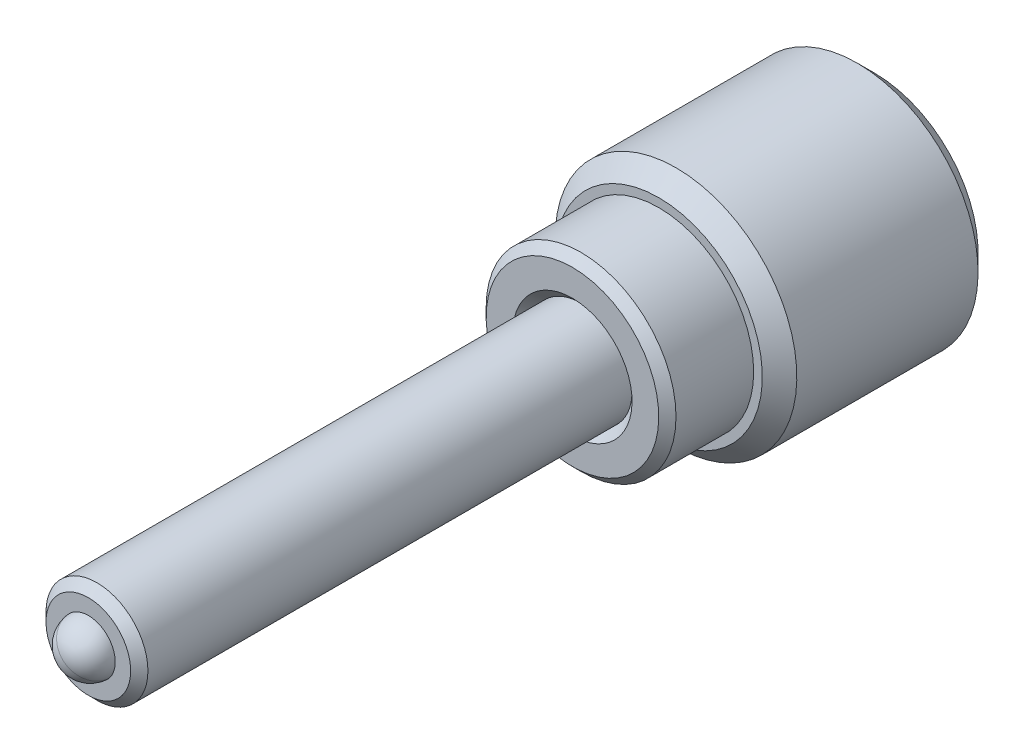
ISO-10303-21;
HEADER;
FILE_DESCRIPTION(('STEP AP214'),'2;1');
FILE_NAME('part.step','',(''),(''),'','','');
FILE_SCHEMA(('AUTOMOTIVE_DESIGN { 1 0 10303 214 1 1 1 1 }'));
ENDSEC;
DATA;
#1=APPLICATION_CONTEXT('core data for automotive mechanical design processes');
#2=APPLICATION_PROTOCOL_DEFINITION('international standard','automotive_design',2000,#1);
#3=PRODUCT_CONTEXT('',#1,'mechanical');
#4=PRODUCT('Part','Part','',(#3));
#5=PRODUCT_RELATED_PRODUCT_CATEGORY('part','',(#4));
#6=PRODUCT_DEFINITION_FORMATION('','',#4);
#7=PRODUCT_DEFINITION_CONTEXT('part definition',#1,'design');
#8=PRODUCT_DEFINITION('design','',#6,#7);
#9=PRODUCT_DEFINITION_SHAPE('','',#8);
#10=(LENGTH_UNIT() NAMED_UNIT(*) SI_UNIT(.MILLI.,.METRE.));
#11=(NAMED_UNIT(*) PLANE_ANGLE_UNIT() SI_UNIT($,.RADIAN.));
#12=(NAMED_UNIT(*) SI_UNIT($,.STERADIAN.) SOLID_ANGLE_UNIT());
#13=UNCERTAINTY_MEASURE_WITH_UNIT(LENGTH_MEASURE(1.E-05),#10,'distance_accuracy_value','');
#14=(GEOMETRIC_REPRESENTATION_CONTEXT(3) GLOBAL_UNCERTAINTY_ASSIGNED_CONTEXT((#13)) GLOBAL_UNIT_ASSIGNED_CONTEXT((#10,
#11,#12)) REPRESENTATION_CONTEXT('',''));
#15=CARTESIAN_POINT('',(0.,0.,0.));
#16=DIRECTION('',(0.,0.,1.));
#17=DIRECTION('',(1.,0.,0.));
#18=AXIS2_PLACEMENT_3D('',#15,#16,#17);
#19=CARTESIAN_POINT('',(-7.26919512616077,-0.0930907809788475,-15.998498581485));
#20=DIRECTION('',(0.,0.,-1.));
#21=DIRECTION('',(0.,1.,0.));
#22=AXIS2_PLACEMENT_3D('',#19,#20,#21);
#23=PLANE('',#22);
#24=CARTESIAN_POINT('',(-1.45830924969914,-0.0930907809788471,-15.998498581485));
#25=DIRECTION('',(0.,0.,-1.));
#26=DIRECTION('',(0.,1.,0.));
#27=AXIS2_PLACEMENT_3D('',#24,#25,#26);
#28=CIRCLE('',#27,2.413);
#29=CARTESIAN_POINT('',(-1.45830924969914,2.31990921902115,-15.998498581485));
#30=VERTEX_POINT('',#29);
#31=EDGE_CURVE('P0_E29',#30,#30,#28,.T.);
#32=ORIENTED_EDGE('',*,*,#31,.T.);
#33=EDGE_LOOP('',(#32));
#34=FACE_BOUND('',#33,.T.);
#35=CARTESIAN_POINT('',(-1.45830924969914,-0.0930907809788471,-15.998498581485));
#36=DIRECTION('',(0.,0.,-1.));
#37=DIRECTION('',(-1.,0.,0.));
#38=AXIS2_PLACEMENT_3D('',#35,#36,#37);
#39=CIRCLE('',#38,1.15470053837925);
#40=CARTESIAN_POINT('',(-2.03565951888877,0.906909219021155,-15.998498581485));
#41=VERTEX_POINT('',#40);
#42=CARTESIAN_POINT('',(-0.880958980509518,0.906909219021155,-15.998498581485));
#43=VERTEX_POINT('',#42);
#44=EDGE_CURVE('P0_E42',#41,#43,#39,.T.);
#45=ORIENTED_EDGE('',*,*,#44,.F.);
#46=CARTESIAN_POINT('',(-2.61300978807839,-0.093090780978849,-15.998498581485));
#47=VERTEX_POINT('',#46);
#48=EDGE_CURVE('P0_E110',#47,#41,#39,.T.);
#49=ORIENTED_EDGE('',*,*,#48,.F.);
#50=CARTESIAN_POINT('',(-2.03565951888877,-1.09309078097885,-15.998498581485));
#51=VERTEX_POINT('',#50);
#52=EDGE_CURVE('P0_E109',#51,#47,#39,.T.);
#53=ORIENTED_EDGE('',*,*,#52,.F.);
#54=CARTESIAN_POINT('',(-0.880958980509515,-1.09309078097885,-15.998498581485));
#55=VERTEX_POINT('',#54);
#56=EDGE_CURVE('P0_E81',#55,#51,#39,.T.);
#57=ORIENTED_EDGE('',*,*,#56,.F.);
#58=CARTESIAN_POINT('',(-0.303608711319889,-0.0930907809788469,-15.998498581485));
#59=VERTEX_POINT('',#58);
#60=EDGE_CURVE('P0_E74',#59,#55,#39,.T.);
#61=ORIENTED_EDGE('',*,*,#60,.F.);
#62=EDGE_CURVE('P0_E35',#43,#59,#39,.T.);
#63=ORIENTED_EDGE('',*,*,#62,.F.);
#64=EDGE_LOOP('',(#45,#49,#53,#57,#61,#63));
#65=FACE_BOUND('',#64,.T.);
#66=ADVANCED_FACE('P0_F16',(#34,#65),#23,.T.);
#67=CARTESIAN_POINT('',(-1.45830924969914,-0.0930907809788465,-16.506498581485));
#68=DIRECTION('',(0.,0.,-1.));
#69=DIRECTION('',(0.,1.,0.));
#70=AXIS2_PLACEMENT_3D('',#67,#68,#69);
#71=CYLINDRICAL_SURFACE('',#70,2.413);
#72=CARTESIAN_POINT('',(-1.45830924969914,-0.0930907809788465,-16.506498581485));
#73=DIRECTION('',(0.,0.,-1.));
#74=DIRECTION('',(0.,1.,0.));
#75=AXIS2_PLACEMENT_3D('',#72,#73,#74);
#76=CIRCLE('',#75,2.413);
#77=CARTESIAN_POINT('',(-1.45830924969914,2.31990921902116,-16.506498581485));
#78=VERTEX_POINT('',#77);
#79=EDGE_CURVE('P0_E189',#78,#78,#76,.T.);
#80=ORIENTED_EDGE('',*,*,#79,.T.);
#81=EDGE_LOOP('',(#80));
#82=FACE_BOUND('',#81,.T.);
#83=ORIENTED_EDGE('',*,*,#31,.F.);
#84=EDGE_LOOP('',(#83));
#85=FACE_BOUND('',#84,.T.);
#86=ADVANCED_FACE('P0_F177',(#82,#85),#71,.F.);
#87=CARTESIAN_POINT('',(-7.26919512616077,-0.0930907809788469,-16.506498581485));
#88=DIRECTION('',(0.,0.,-1.));
#89=DIRECTION('',(0.,1.,0.));
#90=AXIS2_PLACEMENT_3D('',#87,#88,#89);
#91=PLANE('',#90);
#92=CARTESIAN_POINT('',(-1.45830924969914,-0.0930907809788465,-16.506498581485));
#93=DIRECTION('',(0.,0.,-1.));
#94=DIRECTION('',(0.,1.,0.));
#95=AXIS2_PLACEMENT_3D('',#92,#93,#94);
#96=CIRCLE('',#95,3.048);
#97=CARTESIAN_POINT('',(-1.45830924969914,2.95490921902116,-16.506498581485));
#98=VERTEX_POINT('',#97);
#99=EDGE_CURVE('P0_E191',#98,#98,#96,.T.);
#100=ORIENTED_EDGE('',*,*,#99,.T.);
#101=EDGE_LOOP('',(#100));
#102=FACE_BOUND('',#101,.T.);
#103=ORIENTED_EDGE('',*,*,#79,.F.);
#104=EDGE_LOOP('',(#103));
#105=FACE_BOUND('',#104,.T.);
#106=ADVANCED_FACE('P0_F184',(#102,#105),#91,.T.);
#107=CARTESIAN_POINT('',(-1.45830924969914,-0.0930907809788465,-16.506498581485));
#108=DIRECTION('',(0.,0.,1.));
#109=DIRECTION('',(0.,-1.,0.));
#110=AXIS2_PLACEMENT_3D('',#107,#108,#109);
#111=CONICAL_SURFACE('',#110,3.048,0.78539816339745);
#112=CARTESIAN_POINT('',(-1.45830924969914,-0.0930907809788471,-15.998498581485));
#113=DIRECTION('',(0.,0.,-1.));
#114=DIRECTION('',(0.,1.,0.));
#115=AXIS2_PLACEMENT_3D('',#112,#113,#114);
#116=CIRCLE('',#115,3.556);
#117=CARTESIAN_POINT('',(-1.45830924969914,3.46290921902116,-15.998498581485));
#118=VERTEX_POINT('',#117);
#119=EDGE_CURVE('P0_E196',#118,#118,#116,.T.);
#120=ORIENTED_EDGE('',*,*,#119,.T.);
#121=EDGE_LOOP('',(#120));
#122=FACE_BOUND('',#121,.T.);
#123=ORIENTED_EDGE('',*,*,#99,.F.);
#124=EDGE_LOOP('',(#123));
#125=FACE_BOUND('',#124,.T.);
#126=ADVANCED_FACE('P0_F307',(#122,#125),#111,.T.);
#127=CARTESIAN_POINT('',(-1.45830924969914,-0.0930907809788465,-16.506498581485));
#128=DIRECTION('',(0.,0.,-1.));
#129=DIRECTION('',(0.,1.,0.));
#130=AXIS2_PLACEMENT_3D('',#127,#128,#129);
#131=CYLINDRICAL_SURFACE('',#130,3.556);
#132=CARTESIAN_POINT('',(-1.45830924969914,-0.093090780978853,-10.664498581485));
#133=DIRECTION('',(0.,0.,-1.));
#134=DIRECTION('',(0.,1.,0.));
#135=AXIS2_PLACEMENT_3D('',#132,#133,#134);
#136=CIRCLE('',#135,3.556);
#137=CARTESIAN_POINT('',(-1.45830924969914,3.46290921902115,-10.664498581485));
#138=VERTEX_POINT('',#137);
#139=EDGE_CURVE('P0_E199',#138,#138,#136,.T.);
#140=ORIENTED_EDGE('',*,*,#139,.T.);
#141=EDGE_LOOP('',(#140));
#142=FACE_BOUND('',#141,.T.);
#143=ORIENTED_EDGE('',*,*,#119,.F.);
#144=EDGE_LOOP('',(#143));
#145=FACE_BOUND('',#144,.T.);
#146=ADVANCED_FACE('P0_F303',(#142,#145),#131,.T.);
#147=CARTESIAN_POINT('',(-1.45830924969914,-0.093090780978853,-10.664498581485));
#148=DIRECTION('',(0.,0.,-1.));
#149=DIRECTION('',(0.,1.,0.));
#150=AXIS2_PLACEMENT_3D('',#147,#148,#149);
#151=CONICAL_SURFACE('',#150,3.556,0.78539816339745);
#152=CARTESIAN_POINT('',(-1.45830924969914,-0.0930907809788536,-10.156498581485));
#153=DIRECTION('',(0.,0.,-1.));
#154=DIRECTION('',(0.,1.,0.));
#155=AXIS2_PLACEMENT_3D('',#152,#153,#154);
#156=CIRCLE('',#155,3.048);
#157=CARTESIAN_POINT('',(-1.45830924969914,2.95490921902115,-10.156498581485));
#158=VERTEX_POINT('',#157);
#159=EDGE_CURVE('P0_E202',#158,#158,#156,.T.);
#160=ORIENTED_EDGE('',*,*,#159,.T.);
#161=EDGE_LOOP('',(#160));
#162=FACE_BOUND('',#161,.T.);
#163=ORIENTED_EDGE('',*,*,#139,.F.);
#164=EDGE_LOOP('',(#163));
#165=FACE_BOUND('',#164,.T.);
#166=ADVANCED_FACE('P0_F299',(#162,#165),#151,.T.);
#167=CARTESIAN_POINT('',(-7.26919512616077,-0.093090780978854,-10.156498581485));
#168=DIRECTION('',(0.,0.,1.));
#169=DIRECTION('',(0.,-1.,0.));
#170=AXIS2_PLACEMENT_3D('',#167,#168,#169);
#171=PLANE('',#170);
#172=CARTESIAN_POINT('',(-1.45830924969914,-0.0930907809788536,-10.156498581485));
#173=DIRECTION('',(0.,0.,-1.));
#174=DIRECTION('',(0.,1.,0.));
#175=AXIS2_PLACEMENT_3D('',#172,#173,#174);
#176=CIRCLE('',#175,2.794);
#177=CARTESIAN_POINT('',(-1.45830924969914,2.70090921902115,-10.156498581485));
#178=VERTEX_POINT('',#177);
#179=EDGE_CURVE('P0_E205',#178,#178,#176,.T.);
#180=ORIENTED_EDGE('',*,*,#179,.T.);
#181=EDGE_LOOP('',(#180));
#182=FACE_BOUND('',#181,.T.);
#183=ORIENTED_EDGE('',*,*,#159,.F.);
#184=EDGE_LOOP('',(#183));
#185=FACE_BOUND('',#184,.T.);
#186=ADVANCED_FACE('P0_F295',(#182,#185),#171,.T.);
#187=CARTESIAN_POINT('',(-1.45830924969914,-0.0930907809788465,-16.506498581485));
#188=DIRECTION('',(0.,0.,-1.));
#189=DIRECTION('',(0.,1.,0.));
#190=AXIS2_PLACEMENT_3D('',#187,#188,#189);
#191=CYLINDRICAL_SURFACE('',#190,2.794);
#192=CARTESIAN_POINT('',(-1.45830924969914,-0.0930907809788561,-7.87049858148497));
#193=DIRECTION('',(0.,0.,-1.));
#194=DIRECTION('',(0.,1.,0.));
#195=AXIS2_PLACEMENT_3D('',#192,#193,#194);
#196=CIRCLE('',#195,2.794);
#197=CARTESIAN_POINT('',(-1.45830924969914,2.70090921902115,-7.87049858148496));
#198=VERTEX_POINT('',#197);
#199=EDGE_CURVE('P0_E208',#198,#198,#196,.T.);
#200=ORIENTED_EDGE('',*,*,#199,.T.);
#201=EDGE_LOOP('',(#200));
#202=FACE_BOUND('',#201,.T.);
#203=ORIENTED_EDGE('',*,*,#179,.F.);
#204=EDGE_LOOP('',(#203));
#205=FACE_BOUND('',#204,.T.);
#206=ADVANCED_FACE('P0_F291',(#202,#205),#191,.T.);
#207=CARTESIAN_POINT('',(-1.45830924969914,-0.0930907809788561,-7.87049858148497));
#208=DIRECTION('',(0.,0.,-1.));
#209=DIRECTION('',(0.,1.,0.));
#210=AXIS2_PLACEMENT_3D('',#207,#208,#209);
#211=CONICAL_SURFACE('',#210,2.794,0.785398163397447);
#212=CARTESIAN_POINT('',(-1.45830924969914,-0.0930907809788564,-7.61649858148497));
#213=DIRECTION('',(0.,0.,-1.));
#214=DIRECTION('',(0.,1.,0.));
#215=AXIS2_PLACEMENT_3D('',#212,#213,#214);
#216=CIRCLE('',#215,2.54);
#217=CARTESIAN_POINT('',(-1.45830924969914,2.44690921902115,-7.61649858148497));
#218=VERTEX_POINT('',#217);
#219=EDGE_CURVE('P0_E211',#218,#218,#216,.T.);
#220=ORIENTED_EDGE('',*,*,#219,.T.);
#221=EDGE_LOOP('',(#220));
#222=FACE_BOUND('',#221,.T.);
#223=ORIENTED_EDGE('',*,*,#199,.F.);
#224=EDGE_LOOP('',(#223));
#225=FACE_BOUND('',#224,.T.);
#226=ADVANCED_FACE('P0_F287',(#222,#225),#211,.T.);
#227=CARTESIAN_POINT('',(-7.26919512616077,-0.0930907809788568,-7.61649858148497));
#228=DIRECTION('',(0.,0.,1.));
#229=DIRECTION('',(0.,-1.,0.));
#230=AXIS2_PLACEMENT_3D('',#227,#228,#229);
#231=PLANE('',#230);
#232=CARTESIAN_POINT('',(-1.45830924969914,-0.0930907809788564,-7.61649858148497));
#233=DIRECTION('',(0.,0.,-1.));
#234=DIRECTION('',(0.,1.,0.));
#235=AXIS2_PLACEMENT_3D('',#232,#233,#234);
#236=CIRCLE('',#235,1.754);
#237=CARTESIAN_POINT('',(-1.45830924969914,1.66090921902115,-7.61649858148497));
#238=VERTEX_POINT('',#237);
#239=EDGE_CURVE('P0_E214',#238,#238,#236,.T.);
#240=ORIENTED_EDGE('',*,*,#239,.T.);
#241=EDGE_LOOP('',(#240));
#242=FACE_BOUND('',#241,.T.);
#243=ORIENTED_EDGE('',*,*,#219,.F.);
#244=EDGE_LOOP('',(#243));
#245=FACE_BOUND('',#244,.T.);
#246=ADVANCED_FACE('P0_F283',(#242,#245),#231,.T.);
#247=CARTESIAN_POINT('',(-1.45830924969914,-0.0930907809788564,-7.61649858148497));
#248=DIRECTION('',(0.,0.,1.));
#249=DIRECTION('',(0.,-1.,0.));
#250=AXIS2_PLACEMENT_3D('',#247,#248,#249);
#251=CONICAL_SURFACE('',#250,1.754,0.785398163397448);
#252=CARTESIAN_POINT('',(-1.45830924969914,-0.0930907809788561,-7.87049858148497));
#253=DIRECTION('',(0.,0.,-1.));
#254=DIRECTION('',(0.,1.,0.));
#255=AXIS2_PLACEMENT_3D('',#252,#253,#254);
#256=CIRCLE('',#255,1.5);
#257=CARTESIAN_POINT('',(-1.45830924969914,1.40690921902115,-7.87049858148497));
#258=VERTEX_POINT('',#257);
#259=EDGE_CURVE('P0_E217',#258,#258,#256,.T.);
#260=ORIENTED_EDGE('',*,*,#259,.T.);
#261=EDGE_LOOP('',(#260));
#262=FACE_BOUND('',#261,.T.);
#263=ORIENTED_EDGE('',*,*,#239,.F.);
#264=EDGE_LOOP('',(#263));
#265=FACE_BOUND('',#264,.T.);
#266=ADVANCED_FACE('P0_F275',(#262,#265),#251,.F.);
#267=CARTESIAN_POINT('',(-1.45830924969914,-0.0930907809788465,-16.506498581485));
#268=DIRECTION('',(0.,0.,-1.));
#269=DIRECTION('',(0.,1.,0.));
#270=AXIS2_PLACEMENT_3D('',#267,#268,#269);
#271=CYLINDRICAL_SURFACE('',#270,1.5);
#272=ORIENTED_EDGE('',*,*,#259,.F.);
#273=EDGE_LOOP('',(#272));
#274=FACE_BOUND('',#273,.T.);
#275=CARTESIAN_POINT('',(-1.45830924969914,-0.0930907809788507,-12.696498581485));
#276=DIRECTION('',(0.,0.,-1.));
#277=DIRECTION('',(0.,1.,0.));
#278=AXIS2_PLACEMENT_3D('',#275,#276,#277);
#279=CIRCLE('',#278,1.5);
#280=CARTESIAN_POINT('',(-1.45830924969914,1.40690921902115,-12.696498581485));
#281=VERTEX_POINT('',#280);
#282=EDGE_CURVE('P0_E220',#281,#281,#279,.T.);
#283=ORIENTED_EDGE('',*,*,#282,.T.);
#284=EDGE_LOOP('',(#283));
#285=FACE_BOUND('',#284,.T.);
#286=ADVANCED_FACE('P0_F268',(#274,#285),#271,.F.);
#287=CARTESIAN_POINT('',(-7.26919512616077,-0.0930907809788512,-12.696498581485));
#288=DIRECTION('',(0.,0.,-1.));
#289=DIRECTION('',(0.,1.,0.));
#290=AXIS2_PLACEMENT_3D('',#287,#288,#289);
#291=PLANE('',#290);
#292=ORIENTED_EDGE('',*,*,#282,.F.);
#293=EDGE_LOOP('',(#292));
#294=FACE_BOUND('',#293,.T.);
#295=ADVANCED_FACE('P0_F263',(#294),#291,.F.);
#296=CARTESIAN_POINT('',(-1.45830924969914,-0.0930907809788474,-15.744498581485));
#297=DIRECTION('',(0.,0.,-1.));
#298=DIRECTION('',(-1.,0.,0.));
#299=AXIS2_PLACEMENT_3D('',#296,#297,#298);
#300=CONICAL_SURFACE('',#299,0.900700538379251,0.785398163397448);
#301=CARTESIAN_POINT('',(-2.62347761218416,-1.09309078097885,-16.379251498257));
#302=CARTESIAN_POINT('',(-2.59516742964959,-1.09309078097885,-16.3577717633388));
#303=CARTESIAN_POINT('',(-2.56670100343969,-1.09309078097885,-16.3364985553642));
#304=CARTESIAN_POINT('',(-2.50939177293914,-1.09309078097885,-16.2944509162557));
#305=CARTESIAN_POINT('',(-2.4805488780026,-1.09309078097885,-16.2736766087985));
#306=CARTESIAN_POINT('',(-2.39293728056524,-1.09309078097885,-16.2119339989149));
#307=CARTESIAN_POINT('',(-2.33351587184543,-1.09309078097885,-16.1718766202536));
#308=CARTESIAN_POINT('',(-2.20882235717248,-1.09309078097885,-16.0931126760535));
#309=CARTESIAN_POINT('',(-2.14341153352617,-1.09309078097885,-16.0546232695726));
#310=CARTESIAN_POINT('',(-2.00930546326463,-1.09309078097885,-15.9841298594638));
#311=CARTESIAN_POINT('',(-1.94062230455765,-1.09309078097885,-15.9521039757891));
#312=CARTESIAN_POINT('',(-1.83765872535351,-1.09309078097885,-15.9129192263925));
#313=CARTESIAN_POINT('',(-1.80493180143575,-1.09309078097885,-15.9016961845677));
#314=CARTESIAN_POINT('',(-1.73867588657635,-1.09309078097885,-15.8818759133746));
#315=CARTESIAN_POINT('',(-1.70514684169575,-1.09309078097885,-15.8732788611302));
#316=CARTESIAN_POINT('',(-1.6380592976752,-1.09309078097885,-15.859305387565));
#317=CARTESIAN_POINT('',(-1.60451275234315,-1.09309078097885,-15.8538724789247));
#318=CARTESIAN_POINT('',(-1.53703486065201,-1.09309078097885,-15.8463321401087));
#319=CARTESIAN_POINT('',(-1.50310345995469,-1.09309078097885,-15.8442251855671));
#320=CARTESIAN_POINT('',(-1.43649517076453,-1.09309078097885,-15.8435025086952));
#321=CARTESIAN_POINT('',(-1.40381965095774,-1.09309078097885,-15.844757053392));
#322=CARTESIAN_POINT('',(-1.33875280250116,-1.09309078097885,-15.8503977558136));
#323=CARTESIAN_POINT('',(-1.30636140930827,-1.09309078097885,-15.8547831826342));
#324=CARTESIAN_POINT('',(-1.24153231846985,-1.09309078097885,-15.8665182895832));
#325=CARTESIAN_POINT('',(-1.20910406816712,-1.09309078097885,-15.8739193659409));
#326=CARTESIAN_POINT('',(-1.14495791720511,-1.09309078097885,-15.8912882890726));
#327=CARTESIAN_POINT('',(-1.11323996210838,-1.09309078097885,-15.901255938406));
#328=CARTESIAN_POINT('',(-1.01399613240288,-1.09309078097885,-15.936210481547));
#329=CARTESIAN_POINT('',(-0.947866906953462,-1.09309078097885,-15.965152556141));
#330=CARTESIAN_POINT('',(-0.818709666999034,-1.09309078097885,-16.029518806705));
#331=CARTESIAN_POINT('',(-0.755693790213961,-1.09309078097885,-16.0649661470024));
#332=CARTESIAN_POINT('',(-0.635252719121948,-1.09309078097885,-16.1381155949302));
#333=CARTESIAN_POINT('',(-0.577705233913311,-1.09309078097885,-16.1756188544473));
#334=CARTESIAN_POINT('',(-0.492920846481085,-1.09309078097885,-16.2336029538332));
#335=CARTESIAN_POINT('',(-0.465024975327513,-1.09309078097885,-16.2531369781868));
#336=CARTESIAN_POINT('',(-0.409614867699111,-1.09309078097885,-16.2927237618771));
#337=CARTESIAN_POINT('',(-0.382100528858519,-1.09309078097885,-16.3127763777698));
#338=CARTESIAN_POINT('',(-0.35474513022036,-1.09309078097885,-16.333044082483));
#339=B_SPLINE_CURVE_WITH_KNOTS('',3,(#301,#302,#303,#304,#305,#306,#307,#308,#309,#310,#311,
#312,#313,#314,#315,#316,#317,#318,#319,#320,#321,#322,#323,#324,#325,#326,#327,#328,#329,#330,
#331,#332,#333,#334,#335,#336,#337,#338),.UNSPECIFIED.,.F.,.F.,(4,2,2,2,2,2,2,2,2,2,2,2,2,2,2,2,
2,2,4),(0.,0.106606940896333,0.213240042246483,0.428132991376098,0.655634512005478,
0.882352486401554,0.986058447883157,1.08977140282763,1.19157109890218,1.29338535170645,
1.39132734377512,1.48924647876187,1.58890934146288,1.68856453961813,1.90448646818009,
2.12119273268527,2.32715767052323,2.42931938152475,2.53145313028664),.UNSPECIFIED.);
#340=EDGE_CURVE('P0_E11',#51,#55,#339,.T.);
#341=ORIENTED_EDGE('',*,*,#340,.T.);
#342=ORIENTED_EDGE('',*,*,#56,.T.);
#343=EDGE_LOOP('',(#341,#342));
#344=FACE_BOUND('',#343,.T.);
#345=ADVANCED_FACE('P0_F86',(#344),#300,.F.);
#346=CARTESIAN_POINT('',(-2.61312525813223,-0.0928907809788475,-15.9986140688576));
#347=CARTESIAN_POINT('',(-2.5932744576494,-0.127273375986027,-15.9787765123107));
#348=CARTESIAN_POINT('',(-2.57309172225856,-0.162230899118671,-15.9601036021239));
#349=CARTESIAN_POINT('',(-2.53193664499133,-0.233513583934936,-15.9259133242081));
#350=CARTESIAN_POINT('',(-2.51096038527994,-0.26984553150783,-15.9104149905084));
#351=CARTESIAN_POINT('',(-2.46866262879717,-0.343107394782157,-15.8838658886272));
#352=CARTESIAN_POINT('',(-2.44735191580838,-0.38001863242426,-15.8727483554819));
#353=CARTESIAN_POINT('',(-2.40426144898183,-0.454653510289706,-15.8556184472612));
#354=CARTESIAN_POINT('',(-2.38248301232574,-0.492374869087483,-15.8495932789516));
#355=CARTESIAN_POINT('',(-2.34495056233916,-0.55738297939678,-15.8441591364525));
#356=CARTESIAN_POINT('',(-2.32924538037142,-0.584585152507018,-15.8433555198017));
#357=CARTESIAN_POINT('',(-2.29786542956199,-0.638936821647957,-15.8447052809019));
#358=CARTESIAN_POINT('',(-2.28219066819407,-0.666086304733721,-15.8468593110322));
#359=CARTESIAN_POINT('',(-2.23539022029851,-0.747147058305805,-15.8576155536134));
#360=CARTESIAN_POINT('',(-2.20449744081558,-0.800654921957273,-15.8705131379003));
#361=CARTESIAN_POINT('',(-2.15027736611879,-0.894566846122277,-15.9016393120872));
#362=CARTESIAN_POINT('',(-2.12669580699252,-0.93541130465068,-15.9182363791868));
#363=CARTESIAN_POINT('',(-2.08045633563282,-1.01550041836079,-15.9556235061703));
#364=CARTESIAN_POINT('',(-2.05779569928372,-1.05474979184928,-15.9763999233024));
#365=CARTESIAN_POINT('',(-2.03554404883493,-1.09329078097885,-15.9986140688576));
#366=B_SPLINE_CURVE_WITH_KNOTS('',3,(#346,#347,#348,#349,#350,#351,#352,#353,#354,#355,#356,
#357,#358,#359,#360,#361,#362,#363,#364,#365),.UNSPECIFIED.,.F.,.F.,(4,2,2,2,2,2,2,2,2,4),(0.,
0.133237676828559,0.26725222983449,0.3991370762693,0.530689603280768,0.624814864263845,
0.718960890149132,0.907306626112095,1.05710100361789,1.20641411519286),.UNSPECIFIED.);
#367=EDGE_CURVE('P0_E113',#47,#51,#366,.T.);
#368=ORIENTED_EDGE('',*,*,#367,.T.);
#369=ORIENTED_EDGE('',*,*,#52,.T.);
#370=EDGE_LOOP('',(#368,#369));
#371=FACE_BOUND('',#370,.T.);
#372=ADVANCED_FACE('P0_F255',(#371),#300,.F.);
#373=CARTESIAN_POINT('',(-2.03554404883493,0.907109219021155,-15.9986140688576));
#374=CARTESIAN_POINT('',(-2.05539484931776,0.872726624013974,-15.9787765123107));
#375=CARTESIAN_POINT('',(-2.0755775847086,0.83776910088133,-15.9601036021239));
#376=CARTESIAN_POINT('',(-2.11673266197583,0.766486416065065,-15.9259133242081));
#377=CARTESIAN_POINT('',(-2.13770892168722,0.730154468492171,-15.9104149905084));
#378=CARTESIAN_POINT('',(-2.18000667816999,0.656892605217844,-15.8838658886272));
#379=CARTESIAN_POINT('',(-2.20131739115878,0.619981367575741,-15.8727483554819));
#380=CARTESIAN_POINT('',(-2.24440785798533,0.545346489710296,-15.8556184472612));
#381=CARTESIAN_POINT('',(-2.26618629464142,0.50762513091252,-15.8495932789516));
#382=CARTESIAN_POINT('',(-2.303718744628,0.442617020603222,-15.8441591364525));
#383=CARTESIAN_POINT('',(-2.31942392659574,0.415414847492984,-15.8433555198017));
#384=CARTESIAN_POINT('',(-2.35080387740517,0.361063178352044,-15.8447052809019));
#385=CARTESIAN_POINT('',(-2.36647863877309,0.333913695266281,-15.8468593110322));
#386=CARTESIAN_POINT('',(-2.41327908666865,0.252852941694196,-15.8576155536134));
#387=CARTESIAN_POINT('',(-2.44417186615159,0.199345078042729,-15.8705131379003));
#388=CARTESIAN_POINT('',(-2.49839194084837,0.105433153877724,-15.9016393120871));
#389=CARTESIAN_POINT('',(-2.52197349997465,0.0645886953493211,-15.9182363791868));
#390=CARTESIAN_POINT('',(-2.56821297133434,-0.0155004183607893,-15.9556235061703));
#391=CARTESIAN_POINT('',(-2.59087360768344,-0.0547497918492838,-15.9763999233024));
#392=CARTESIAN_POINT('',(-2.61312525813223,-0.0932907809788472,-15.9986140688576));
#393=B_SPLINE_CURVE_WITH_KNOTS('',3,(#373,#374,#375,#376,#377,#378,#379,#380,#381,#382,#383,
#384,#385,#386,#387,#388,#389,#390,#391,#392),.UNSPECIFIED.,.F.,.F.,(4,2,2,2,2,2,2,2,2,4),(0.,
0.133237676828558,0.267252229834489,0.399137076269299,0.530689603280767,0.624814864263844,
0.718960890149131,0.907306626112094,1.05710100361789,1.20641411519286),.UNSPECIFIED.);
#394=EDGE_CURVE('P0_E120',#41,#47,#393,.T.);
#395=ORIENTED_EDGE('',*,*,#394,.T.);
#396=ORIENTED_EDGE('',*,*,#48,.T.);
#397=EDGE_LOOP('',(#395,#396));
#398=FACE_BOUND('',#397,.T.);
#399=ADVANCED_FACE('P0_F251',(#398),#300,.F.);
#400=CARTESIAN_POINT('',(-2.62347761224953,0.906909219021156,-16.3792514983066));
#401=CARTESIAN_POINT('',(-2.5951674297131,0.906909219021156,-16.3577717633865));
#402=CARTESIAN_POINT('',(-2.56670100350135,0.906909219021156,-16.33649855541));
#403=CARTESIAN_POINT('',(-2.50939177299707,0.906909219021155,-16.2944509162976));
#404=CARTESIAN_POINT('',(-2.48054887805867,0.906909219021155,-16.2736766088386));
#405=CARTESIAN_POINT('',(-2.39293728061557,0.906909219021155,-16.2119339989492));
#406=CARTESIAN_POINT('',(-2.33351587189187,0.906909219021155,-16.1718766202841));
#407=CARTESIAN_POINT('',(-2.20882235721042,0.906909219021155,-16.0931126760762));
#408=CARTESIAN_POINT('',(-2.14341153355949,0.906909219021155,-16.0546232695913));
#409=CARTESIAN_POINT('',(-2.0093054632883,0.906909219021155,-15.9841298594751));
#410=CARTESIAN_POINT('',(-1.9406223045763,0.906909219021155,-15.9521039757969));
#411=CARTESIAN_POINT('',(-1.8376587253684,0.906909219021155,-15.9129192263978));
#412=CARTESIAN_POINT('',(-1.80493180145223,0.906909219021155,-15.9016961845732));
#413=CARTESIAN_POINT('',(-1.73867588659607,0.906909219021155,-15.88187591338));
#414=CARTESIAN_POINT('',(-1.70514684171712,0.906909219021155,-15.8732788611354));
#415=CARTESIAN_POINT('',(-1.63805929769981,0.906909219021155,-15.8593053875694));
#416=CARTESIAN_POINT('',(-1.60451275236934,0.906909219021155,-15.8538724789285));
#417=CARTESIAN_POINT('',(-1.53703486068134,0.906909219021155,-15.8463321401111));
#418=CARTESIAN_POINT('',(-1.50310345998556,0.906909219021155,-15.8442251855686));
#419=CARTESIAN_POINT('',(-1.43649517079819,0.906909219021155,-15.8435025086945));
#420=CARTESIAN_POINT('',(-1.40381965099264,0.906909219021155,-15.8447570533901));
#421=CARTESIAN_POINT('',(-1.33875280253844,0.906909219021155,-15.8503977558092));
#422=CARTESIAN_POINT('',(-1.30636140934666,0.906909219021155,-15.8547831826284));
#423=CARTESIAN_POINT('',(-1.24153231851045,0.906909219021155,-15.8665182895746));
#424=CARTESIAN_POINT('',(-1.2091040682088,0.906909219021155,-15.8739193659309));
#425=CARTESIAN_POINT('',(-1.14495791724886,0.906909219021155,-15.8912882890596));
#426=CARTESIAN_POINT('',(-1.11323996215311,0.906909219021155,-15.9012559383915));
#427=CARTESIAN_POINT('',(-1.01399613245729,0.906909219021155,-15.9362104815253));
#428=CARTESIAN_POINT('',(-0.947866907016078,0.906909219021155,-15.9651525561128));
#429=CARTESIAN_POINT('',(-0.818709667077442,0.906909219021155,-16.0295188066629));
#430=CARTESIAN_POINT('',(-0.755693790299946,0.906909219021155,-16.0649661469531));
#431=CARTESIAN_POINT('',(-0.635252719221549,0.906909219021155,-16.1381155948669));
#432=CARTESIAN_POINT('',(-0.577705234019,0.906909219021155,-16.1756188543775));
#433=CARTESIAN_POINT('',(-0.492920846595776,0.906909219021155,-16.2336029537536));
#434=CARTESIAN_POINT('',(-0.465024975445161,0.906909219021155,-16.2531369781039));
#435=CARTESIAN_POINT('',(-0.409614867822656,0.906909219021155,-16.2927237617877));
#436=CARTESIAN_POINT('',(-0.382100528985004,0.906909219021155,-16.3127763776771));
#437=CARTESIAN_POINT('',(-0.354745130349781,0.906909219021155,-16.3330440823871));
#438=B_SPLINE_CURVE_WITH_KNOTS('',3,(#400,#401,#402,#403,#404,#405,#406,#407,#408,#409,#410,
#411,#412,#413,#414,#415,#416,#417,#418,#419,#420,#421,#422,#423,#424,#425,#426,#427,#428,#429,
#430,#431,#432,#433,#434,#435,#436,#437),.UNSPECIFIED.,.F.,.F.,(4,2,2,2,2,2,2,2,2,2,2,2,2,2,2,2,
2,2,4),(0.,0.106606940904222,0.213240042262259,0.428132991407944,0.655634512055367,
0.882352486469312,0.986058447946295,1.08977140288616,1.1915710989563,1.29338535175615,
1.39132734382095,1.48924647880384,1.58890934150068,1.68856453965177,1.90448646818343,
2.1211927326581,2.32715767046997,2.42931938145863,2.53145313020765),.UNSPECIFIED.);
#439=EDGE_CURVE('P0_E140',#43,#41,#438,.F.);
#440=ORIENTED_EDGE('',*,*,#439,.T.);
#441=ORIENTED_EDGE('',*,*,#44,.T.);
#442=EDGE_LOOP('',(#440,#441));
#443=FACE_BOUND('',#442,.T.);
#444=ADVANCED_FACE('P0_F262',(#443),#300,.F.);
#445=CARTESIAN_POINT('',(-0.303493241266052,-0.0932907809788472,-15.9986140688576));
#446=CARTESIAN_POINT('',(-0.323344041748885,-0.0589081859716669,-15.9787765123107));
#447=CARTESIAN_POINT('',(-0.34352677713972,-0.0239506628390229,-15.9601036021239));
#448=CARTESIAN_POINT('',(-0.38468185440695,0.0473320219772419,-15.9259133242081));
#449=CARTESIAN_POINT('',(-0.405658114118344,0.0836639695501365,-15.9104149905084));
#450=CARTESIAN_POINT('',(-0.44795587060111,0.156925832824464,-15.8838658886272));
#451=CARTESIAN_POINT('',(-0.4692665835899,0.193837070466567,-15.8727483554819));
#452=CARTESIAN_POINT('',(-0.512357050416449,0.268471948332011,-15.8556184472612));
#453=CARTESIAN_POINT('',(-0.534135487072544,0.306193307129788,-15.8495932789516));
#454=CARTESIAN_POINT('',(-0.571667937059126,0.371201417439085,-15.8441591364525));
#455=CARTESIAN_POINT('',(-0.587373119026865,0.398403590549323,-15.8433555198017));
#456=CARTESIAN_POINT('',(-0.618753069836292,0.452755259690263,-15.8447052809019));
#457=CARTESIAN_POINT('',(-0.634427831204217,0.479904742776027,-15.8468593110322));
#458=CARTESIAN_POINT('',(-0.681228279099773,0.560965496348111,-15.8576155536134));
#459=CARTESIAN_POINT('',(-0.71212105858271,0.614473359999578,-15.8705131379003));
#460=CARTESIAN_POINT('',(-0.766341133279491,0.708385284164583,-15.9016393120871));
#461=CARTESIAN_POINT('',(-0.789922692405769,0.749229742692986,-15.9182363791868));
#462=CARTESIAN_POINT('',(-0.83616216376546,0.829318856403097,-15.9556235061703));
#463=CARTESIAN_POINT('',(-0.858822800114566,0.868568229891592,-15.9763999233024));
#464=CARTESIAN_POINT('',(-0.881074450563354,0.907109219021154,-15.9986140688576));
#465=B_SPLINE_CURVE_WITH_KNOTS('',3,(#445,#446,#447,#448,#449,#450,#451,#452,#453,#454,#455,
#456,#457,#458,#459,#460,#461,#462,#463,#464),.UNSPECIFIED.,.F.,.F.,(4,2,2,2,2,2,2,2,2,4),(0.,
0.133237676828559,0.267252229834491,0.3991370762693,0.530689603280768,0.624814864263845,
0.718960890149131,0.907306626112095,1.05710100361789,1.20641411519286),.UNSPECIFIED.);
#466=EDGE_CURVE('P0_E98',#59,#43,#465,.T.);
#467=ORIENTED_EDGE('',*,*,#466,.T.);
#468=ORIENTED_EDGE('',*,*,#62,.T.);
#469=EDGE_LOOP('',(#467,#468));
#470=FACE_BOUND('',#469,.T.);
#471=ADVANCED_FACE('P0_F133',(#470),#300,.F.);
#472=CARTESIAN_POINT('',(-0.881074450563354,-1.09329078097885,-15.9986140688576));
#473=CARTESIAN_POINT('',(-0.86122365008052,-1.05890818597167,-15.9787765123107));
#474=CARTESIAN_POINT('',(-0.841040914689685,-1.02395066283902,-15.9601036021239));
#475=CARTESIAN_POINT('',(-0.799885837422456,-0.952667978022758,-15.9259133242081));
#476=CARTESIAN_POINT('',(-0.778909577711061,-0.916336030449864,-15.9104149905084));
#477=CARTESIAN_POINT('',(-0.736611821228295,-0.843074167175537,-15.8838658886272));
#478=CARTESIAN_POINT('',(-0.715301108239505,-0.806162929533434,-15.8727483554819));
#479=CARTESIAN_POINT('',(-0.672210641412956,-0.73152805166799,-15.8556184472612));
#480=CARTESIAN_POINT('',(-0.650432204756861,-0.693806692870213,-15.8495932789516));
#481=CARTESIAN_POINT('',(-0.612899754770279,-0.628798582560915,-15.8441591364525));
#482=CARTESIAN_POINT('',(-0.59719457280254,-0.601596409450677,-15.8433555198017));
#483=CARTESIAN_POINT('',(-0.565814621993113,-0.547244740309737,-15.8447052809019));
#484=CARTESIAN_POINT('',(-0.550139860625189,-0.520095257223974,-15.8468593110322));
#485=CARTESIAN_POINT('',(-0.503339412729632,-0.43903450365189,-15.8576155536134));
#486=CARTESIAN_POINT('',(-0.472446633246695,-0.385526640000423,-15.8705131379003));
#487=CARTESIAN_POINT('',(-0.418226558549914,-0.291614715835418,-15.9016393120871));
#488=CARTESIAN_POINT('',(-0.394644999423636,-0.250770257307014,-15.9182363791868));
#489=CARTESIAN_POINT('',(-0.348405528063945,-0.170681143596904,-15.9556235061703));
#490=CARTESIAN_POINT('',(-0.325744891714839,-0.131431770108409,-15.9763999233024));
#491=CARTESIAN_POINT('',(-0.303493241266052,-0.0928907809788472,-15.9986140688576));
#492=B_SPLINE_CURVE_WITH_KNOTS('',3,(#472,#473,#474,#475,#476,#477,#478,#479,#480,#481,#482,
#483,#484,#485,#486,#487,#488,#489,#490,#491),.UNSPECIFIED.,.F.,.F.,(4,2,2,2,2,2,2,2,2,4),(0.,
0.133237676828559,0.26725222983449,0.399137076269299,0.530689603280768,0.624814864263845,
0.718960890149131,0.907306626112095,1.05710100361789,1.20641411519286),.UNSPECIFIED.);
#493=EDGE_CURVE('P0_E77',#55,#59,#492,.T.);
#494=ORIENTED_EDGE('',*,*,#493,.T.);
#495=ORIENTED_EDGE('',*,*,#60,.T.);
#496=EDGE_LOOP('',(#494,#495));
#497=FACE_BOUND('',#496,.T.);
#498=ADVANCED_FACE('P0_F75',(#497),#300,.F.);
#499=CARTESIAN_POINT('',(-1.45830924969914,-2.09309078097885,-13.458498581485));
#500=DIRECTION('',(0.,0.,-1.));
#501=DIRECTION('',(0.,1.,0.));
#502=AXIS2_PLACEMENT_3D('',#499,#500,#501);
#503=PLANE('',#502);
#504=DIRECTION('',(-0.500000000000001,-0.86602540378444,0.));
#505=VECTOR('',#504,1.);
#506=CARTESIAN_POINT('',(-0.303608711319889,-0.0930907809788499,-13.458498581485));
#507=LINE('',#506,#505);
#508=CARTESIAN_POINT('',(-0.303608711319889,-0.0930907809788499,-13.458498581485));
#509=VERTEX_POINT('',#508);
#510=CARTESIAN_POINT('',(-0.880958980509516,-1.09309078097885,-13.458498581485));
#511=VERTEX_POINT('',#510);
#512=EDGE_CURVE('P0_E97',#509,#511,#507,.T.);
#513=ORIENTED_EDGE('',*,*,#512,.T.);
#514=DIRECTION('',(-1.,0.,0.));
#515=VECTOR('',#514,1.);
#516=CARTESIAN_POINT('',(-0.880958980509516,-1.09309078097885,-13.458498581485));
#517=LINE('',#516,#515);
#518=CARTESIAN_POINT('',(-2.03565951888877,-1.09309078097885,-13.458498581485));
#519=VERTEX_POINT('',#518);
#520=EDGE_CURVE('P0_E102',#511,#519,#517,.T.);
#521=ORIENTED_EDGE('',*,*,#520,.T.);
#522=DIRECTION('',(-0.5,0.86602540378444,0.));
#523=VECTOR('',#522,1.);
#524=CARTESIAN_POINT('',(-2.03565951888877,-1.09309078097885,-13.458498581485));
#525=LINE('',#524,#523);
#526=CARTESIAN_POINT('',(-2.61300978807839,-0.0930907809788502,-13.458498581485));
#527=VERTEX_POINT('',#526);
#528=EDGE_CURVE('P0_E241',#519,#527,#525,.T.);
#529=ORIENTED_EDGE('',*,*,#528,.T.);
#530=DIRECTION('',(0.500000000000001,0.86602540378444,0.));
#531=VECTOR('',#530,1.);
#532=CARTESIAN_POINT('',(-2.61300978807839,-0.0930907809788502,-13.458498581485));
#533=LINE('',#532,#531);
#534=CARTESIAN_POINT('',(-2.03565951888877,0.906909219021152,-13.458498581485));
#535=VERTEX_POINT('',#534);
#536=EDGE_CURVE('P0_E238',#527,#535,#533,.T.);
#537=ORIENTED_EDGE('',*,*,#536,.T.);
#538=DIRECTION('',(1.,0.,0.));
#539=VECTOR('',#538,1.);
#540=CARTESIAN_POINT('',(-2.03565951888877,0.906909219021152,-13.458498581485));
#541=LINE('',#540,#539);
#542=CARTESIAN_POINT('',(-0.880958980509516,0.906909219021152,-13.458498581485));
#543=VERTEX_POINT('',#542);
#544=EDGE_CURVE('P0_E235',#535,#543,#541,.T.);
#545=ORIENTED_EDGE('',*,*,#544,.T.);
#546=DIRECTION('',(0.5,-0.86602540378444,0.));
#547=VECTOR('',#546,1.);
#548=CARTESIAN_POINT('',(-0.880958980509516,0.906909219021152,-13.458498581485));
#549=LINE('',#548,#547);
#550=EDGE_CURVE('P0_E105',#543,#509,#549,.T.);
#551=ORIENTED_EDGE('',*,*,#550,.T.);
#552=EDGE_LOOP('',(#513,#521,#529,#537,#545,#551));
#553=FACE_BOUND('',#552,.T.);
#554=ADVANCED_FACE('P0_F132',(#553),#503,.T.);
#555=CARTESIAN_POINT('',(-0.880958980509516,-1.09309078097885,-13.458498581485));
#556=DIRECTION('',(0.,-1.,0.));
#557=DIRECTION('',(-1.,0.,0.));
#558=AXIS2_PLACEMENT_3D('',#555,#556,#557);
#559=PLANE('',#558);
#560=ORIENTED_EDGE('',*,*,#340,.F.);
#561=DIRECTION('',(0.,0.,-1.));
#562=VECTOR('',#561,1.);
#563=CARTESIAN_POINT('',(-2.03565951888877,-1.09309078097885,-13.458498581485));
#564=LINE('',#563,#562);
#565=EDGE_CURVE('P0_E104',#519,#51,#564,.T.);
#566=ORIENTED_EDGE('',*,*,#565,.F.);
#567=ORIENTED_EDGE('',*,*,#520,.F.);
#568=DIRECTION('',(0.,0.,-1.));
#569=VECTOR('',#568,1.);
#570=CARTESIAN_POINT('',(-0.880958980509516,-1.09309078097885,-13.458498581485));
#571=LINE('',#570,#569);
#572=EDGE_CURVE('P0_E94',#511,#55,#571,.T.);
#573=ORIENTED_EDGE('',*,*,#572,.T.);
#574=EDGE_LOOP('',(#560,#566,#567,#573));
#575=FACE_BOUND('',#574,.T.);
#576=ADVANCED_FACE('P0_F100',(#575),#559,.F.);
#577=CARTESIAN_POINT('',(-2.03565951888877,-1.09309078097885,-13.458498581485));
#578=DIRECTION('',(-0.86602540378444,-0.5,0.));
#579=DIRECTION('',(-0.500000000000001,0.86602540378444,0.));
#580=AXIS2_PLACEMENT_3D('',#577,#578,#579);
#581=PLANE('',#580);
#582=ORIENTED_EDGE('',*,*,#367,.F.);
#583=DIRECTION('',(0.,0.,-1.));
#584=VECTOR('',#583,1.);
#585=CARTESIAN_POINT('',(-2.61300978807839,-0.0930907809788502,-13.458498581485));
#586=LINE('',#585,#584);
#587=EDGE_CURVE('P0_E224',#527,#47,#586,.T.);
#588=ORIENTED_EDGE('',*,*,#587,.F.);
#589=ORIENTED_EDGE('',*,*,#528,.F.);
#590=ORIENTED_EDGE('',*,*,#565,.T.);
#591=EDGE_LOOP('',(#582,#588,#589,#590));
#592=FACE_BOUND('',#591,.T.);
#593=ADVANCED_FACE('P0_F127',(#592),#581,.F.);
#594=CARTESIAN_POINT('',(-2.61300978807839,-0.0930907809788502,-13.458498581485));
#595=DIRECTION('',(-0.86602540378444,0.500000000000001,0.));
#596=DIRECTION('',(0.500000000000001,0.86602540378444,0.));
#597=AXIS2_PLACEMENT_3D('',#594,#595,#596);
#598=PLANE('',#597);
#599=ORIENTED_EDGE('',*,*,#394,.F.);
#600=DIRECTION('',(0.,0.,-1.));
#601=VECTOR('',#600,1.);
#602=CARTESIAN_POINT('',(-2.03565951888877,0.906909219021152,-13.458498581485));
#603=LINE('',#602,#601);
#604=EDGE_CURVE('P0_E227',#535,#41,#603,.T.);
#605=ORIENTED_EDGE('',*,*,#604,.F.);
#606=ORIENTED_EDGE('',*,*,#536,.F.);
#607=ORIENTED_EDGE('',*,*,#587,.T.);
#608=EDGE_LOOP('',(#599,#605,#606,#607));
#609=FACE_BOUND('',#608,.T.);
#610=ADVANCED_FACE('P0_F164',(#609),#598,.F.);
#611=CARTESIAN_POINT('',(-2.03565951888877,0.906909219021152,-13.458498581485));
#612=DIRECTION('',(0.,1.,0.));
#613=DIRECTION('',(1.,0.,0.));
#614=AXIS2_PLACEMENT_3D('',#611,#612,#613);
#615=PLANE('',#614);
#616=ORIENTED_EDGE('',*,*,#439,.F.);
#617=DIRECTION('',(0.,0.,-1.));
#618=VECTOR('',#617,1.);
#619=CARTESIAN_POINT('',(-0.880958980509516,0.906909219021152,-13.458498581485));
#620=LINE('',#619,#618);
#621=EDGE_CURVE('P0_E229',#543,#43,#620,.T.);
#622=ORIENTED_EDGE('',*,*,#621,.F.);
#623=ORIENTED_EDGE('',*,*,#544,.F.);
#624=ORIENTED_EDGE('',*,*,#604,.T.);
#625=EDGE_LOOP('',(#616,#622,#623,#624));
#626=FACE_BOUND('',#625,.T.);
#627=ADVANCED_FACE('P0_F160',(#626),#615,.F.);
#628=CARTESIAN_POINT('',(-0.880958980509516,0.906909219021152,-13.458498581485));
#629=DIRECTION('',(0.86602540378444,0.5,0.));
#630=DIRECTION('',(0.5,-0.86602540378444,0.));
#631=AXIS2_PLACEMENT_3D('',#628,#629,#630);
#632=PLANE('',#631);
#633=ORIENTED_EDGE('',*,*,#466,.F.);
#634=DIRECTION('',(0.,0.,-1.));
#635=VECTOR('',#634,1.);
#636=CARTESIAN_POINT('',(-0.303608711319889,-0.0930907809788499,-13.458498581485));
#637=LINE('',#636,#635);
#638=EDGE_CURVE('P0_E96',#509,#59,#637,.T.);
#639=ORIENTED_EDGE('',*,*,#638,.F.);
#640=ORIENTED_EDGE('',*,*,#550,.F.);
#641=ORIENTED_EDGE('',*,*,#621,.T.);
#642=EDGE_LOOP('',(#633,#639,#640,#641));
#643=FACE_BOUND('',#642,.T.);
#644=ADVANCED_FACE('P0_F157',(#643),#632,.F.);
#645=CARTESIAN_POINT('',(-0.303608711319889,-0.0930907809788499,-13.458498581485));
#646=DIRECTION('',(0.86602540378444,-0.500000000000001,0.));
#647=DIRECTION('',(-0.500000000000001,-0.86602540378444,0.));
#648=AXIS2_PLACEMENT_3D('',#645,#646,#647);
#649=PLANE('',#648);
#650=ORIENTED_EDGE('',*,*,#493,.F.);
#651=ORIENTED_EDGE('',*,*,#572,.F.);
#652=ORIENTED_EDGE('',*,*,#512,.F.);
#653=ORIENTED_EDGE('',*,*,#638,.T.);
#654=EDGE_LOOP('',(#650,#651,#652,#653));
#655=FACE_BOUND('',#654,.T.);
#656=ADVANCED_FACE('P0_F92',(#655),#649,.F.);
#657=CLOSED_SHELL('',(#66,#86,#106,#126,#146,#166,#186,#206,#226,#246,#266,#286,#295,#345,#372,
#399,#444,#471,#498,#554,#576,#593,#610,#627,#644,#656));
#658=MANIFOLD_SOLID_BREP('P0_B1',#657);
#659=CARTESIAN_POINT('',(-1.45830924969914,-0.0930907809788558,6.57575141851503));
#660=DIRECTION('',(0.,0.,1.));
#661=DIRECTION('',(0.749078234224138,-0.662481546166871,0.));
#662=AXIS2_PLACEMENT_3D('',#659,#660,#661);
#663=SPHERICAL_SURFACE('',#662,0.79375);
#664=CARTESIAN_POINT('',(-1.45830924969914,-0.0930907809788558,6.57575141851503));
#665=DIRECTION('',(-0.662481546166871,-0.749078234224138,0.));
#666=DIRECTION('',(0.749078234224138,-0.662481546166871,0.));
#667=AXIS2_PLACEMENT_3D('',#664,#665,#666);
#668=CIRCLE('',#667,0.79375);
#669=CARTESIAN_POINT('',(-0.863728401283734,-0.61893550824881,6.57575141851503));
#670=VERTEX_POINT('',#669);
#671=CARTESIAN_POINT('',(-2.05289009811455,0.432753946291098,6.57575141851503));
#672=VERTEX_POINT('',#671);
#673=EDGE_CURVE('P1_E33',#670,#672,#668,.T.);
#674=ORIENTED_EDGE('',*,*,#673,.T.);
#675=CARTESIAN_POINT('',(-1.45830924969914,-0.0930907809788558,6.57575141851503));
#676=DIRECTION('',(0.,0.,1.));
#677=DIRECTION('',(-0.662481546166871,-0.749078234224138,0.));
#678=AXIS2_PLACEMENT_3D('',#675,#676,#677);
#679=CIRCLE('',#678,0.79375);
#680=EDGE_CURVE('P1_E11',#672,#670,#679,.T.);
#681=ORIENTED_EDGE('',*,*,#680,.T.);
#682=EDGE_LOOP('',(#674,#681));
#683=FACE_BOUND('',#682,.T.);
#684=ADVANCED_FACE('P1_F16',(#683),#663,.T.);
#685=ORIENTED_EDGE('',*,*,#673,.F.);
#686=CARTESIAN_POINT('',(-1.45830924969914,-0.0930907809788558,6.57575141851503));
#687=DIRECTION('',(0.,0.,1.));
#688=DIRECTION('',(-0.662481546166871,-0.749078234224138,0.));
#689=AXIS2_PLACEMENT_3D('',#686,#687,#688);
#690=CIRCLE('',#689,0.79375);
#691=EDGE_CURVE('P1_E23',#670,#672,#690,.T.);
#692=ORIENTED_EDGE('',*,*,#691,.T.);
#693=EDGE_LOOP('',(#685,#692));
#694=FACE_BOUND('',#693,.T.);
#695=ADVANCED_FACE('P1_F40',(#694),#663,.T.);
#696=ORIENTED_EDGE('',*,*,#680,.F.);
#697=EDGE_CURVE('P1_E36',#672,#670,#668,.T.);
#698=ORIENTED_EDGE('',*,*,#697,.T.);
#699=EDGE_LOOP('',(#696,#698));
#700=FACE_BOUND('',#699,.T.);
#701=ADVANCED_FACE('P1_F38',(#700),#663,.T.);
#702=ORIENTED_EDGE('',*,*,#691,.F.);
#703=ORIENTED_EDGE('',*,*,#697,.F.);
#704=EDGE_LOOP('',(#702,#703));
#705=FACE_BOUND('',#704,.T.);
#706=ADVANCED_FACE('P1_F18',(#705),#663,.T.);
#707=CLOSED_SHELL('',(#684,#695,#701,#706));
#708=MANIFOLD_SOLID_BREP('P1_B1',#707);
#709=CARTESIAN_POINT('',(-1.45830924969914,1.40690921902114,6.63290141851499));
#710=DIRECTION('',(0.,0.,-1.));
#711=DIRECTION('',(0.,1.,0.));
#712=AXIS2_PLACEMENT_3D('',#709,#710,#711);
#713=PLANE('',#712);
#714=CARTESIAN_POINT('',(-1.45830924969914,-0.0930907809788635,6.632901418515));
#715=DIRECTION('',(0.,0.,-1.));
#716=DIRECTION('',(0.,1.,0.));
#717=AXIS2_PLACEMENT_3D('',#714,#715,#716);
#718=CIRCLE('',#717,0.791689926675842);
#719=CARTESIAN_POINT('',(-1.45830924969914,0.698599145696978,6.632901418515));
#720=VERTEX_POINT('',#719);
#721=EDGE_CURVE('P2_E78',#720,#720,#718,.T.);
#722=ORIENTED_EDGE('',*,*,#721,.T.);
#723=EDGE_LOOP('',(#722));
#724=FACE_BOUND('',#723,.T.);
#725=CARTESIAN_POINT('',(-1.45830924969914,-0.0930907809788646,6.63290141851499));
#726=DIRECTION('',(0.,0.,-1.));
#727=DIRECTION('',(0.,1.,0.));
#728=AXIS2_PLACEMENT_3D('',#725,#726,#727);
#729=CIRCLE('',#728,1.246);
#730=CARTESIAN_POINT('',(-1.45830924969914,1.15290921902114,6.63290141851499));
#731=VERTEX_POINT('',#730);
#732=EDGE_CURVE('P2_E70',#731,#731,#729,.F.);
#733=ORIENTED_EDGE('',*,*,#732,.T.);
#734=EDGE_LOOP('',(#733));
#735=FACE_BOUND('',#734,.T.);
#736=ADVANCED_FACE('P2_F16',(#724,#735),#713,.F.);
#737=CARTESIAN_POINT('',(-1.45830924969914,-0.0930907809788624,7.4252097111161));
#738=DIRECTION('',(0.,0.,1.));
#739=DIRECTION('',(0.,-1.,0.));
#740=AXIS2_PLACEMENT_3D('',#737,#738,#739);
#741=CYLINDRICAL_SURFACE('',#740,1.50000000000003);
#742=CARTESIAN_POINT('',(-1.45830924969914,-0.0930907809789152,-11.318548581485));
#743=DIRECTION('',(0.,0.,1.));
#744=DIRECTION('',(0.,-1.,0.));
#745=AXIS2_PLACEMENT_3D('',#742,#743,#744);
#746=CIRCLE('',#745,1.50000000000003);
#747=CARTESIAN_POINT('',(-1.45830924969914,-1.59309078097894,-11.318548581485));
#748=VERTEX_POINT('',#747);
#749=EDGE_CURVE('P2_E23',#748,#748,#746,.T.);
#750=ORIENTED_EDGE('',*,*,#749,.T.);
#751=EDGE_LOOP('',(#750));
#752=FACE_BOUND('',#751,.T.);
#753=CARTESIAN_POINT('',(-1.45830924969914,-0.0930907809788653,6.37890141851497));
#754=DIRECTION('',(0.,0.,-1.));
#755=DIRECTION('',(0.,1.,0.));
#756=AXIS2_PLACEMENT_3D('',#753,#754,#755);
#757=CIRCLE('',#756,1.50000000000003);
#758=CARTESIAN_POINT('',(-1.45830924969914,1.40690921902116,6.37890141851496));
#759=VERTEX_POINT('',#758);
#760=EDGE_CURVE('P2_E68',#759,#759,#757,.T.);
#761=ORIENTED_EDGE('',*,*,#760,.T.);
#762=EDGE_LOOP('',(#761));
#763=FACE_BOUND('',#762,.T.);
#764=ADVANCED_FACE('P2_F45',(#752,#763),#741,.T.);
#765=CARTESIAN_POINT('',(-1.45830924969914,1.40690921902114,-11.572548581485));
#766=DIRECTION('',(0.,0.,1.));
#767=DIRECTION('',(0.,-1.,0.));
#768=AXIS2_PLACEMENT_3D('',#765,#766,#767);
#769=PLANE('',#768);
#770=CARTESIAN_POINT('',(-1.45830924969914,-0.0930907809789159,-11.572548581485));
#771=DIRECTION('',(0.,0.,1.));
#772=DIRECTION('',(0.,-1.,0.));
#773=AXIS2_PLACEMENT_3D('',#770,#771,#772);
#774=CIRCLE('',#773,1.24600000000005);
#775=CARTESIAN_POINT('',(-1.45830924969914,-1.33909078097897,-11.572548581485));
#776=VERTEX_POINT('',#775);
#777=EDGE_CURVE('P2_E11',#776,#776,#774,.F.);
#778=ORIENTED_EDGE('',*,*,#777,.T.);
#779=EDGE_LOOP('',(#778));
#780=FACE_BOUND('',#779,.T.);
#781=ADVANCED_FACE('P2_F40',(#780),#769,.F.);
#782=CARTESIAN_POINT('',(-1.45830924969914,-0.0930907809788646,6.63290141851499));
#783=DIRECTION('',(0.,0.,-1.));
#784=DIRECTION('',(0.,1.,0.));
#785=AXIS2_PLACEMENT_3D('',#782,#783,#784);
#786=CONICAL_SURFACE('',#785,1.246,0.785398163397445);
#787=ORIENTED_EDGE('',*,*,#760,.F.);
#788=EDGE_LOOP('',(#787));
#789=FACE_BOUND('',#788,.T.);
#790=ORIENTED_EDGE('',*,*,#732,.F.);
#791=EDGE_LOOP('',(#790));
#792=FACE_BOUND('',#791,.T.);
#793=ADVANCED_FACE('P2_F29',(#789,#792),#786,.T.);
#794=CARTESIAN_POINT('',(-1.45830924969914,-0.0930907809788634,5.45321940338135));
#795=DIRECTION('',(0.,0.,1.));
#796=DIRECTION('',(0.,-1.,0.));
#797=AXIS2_PLACEMENT_3D('',#794,#795,#796);
#798=CONICAL_SURFACE('',#797,0.,0.785398163397443);
#799=CARTESIAN_POINT('',(-1.45830924969914,-0.0930907809788635,6.2449093300572));
#800=DIRECTION('',(0.,0.,-1.));
#801=DIRECTION('',(0.,1.,0.));
#802=AXIS2_PLACEMENT_3D('',#799,#800,#801);
#803=CIRCLE('',#802,0.791689926675842);
#804=CARTESIAN_POINT('',(-1.45830924969914,0.698599145696979,6.2449093300572));
#805=VERTEX_POINT('',#804);
#806=EDGE_CURVE('P2_E75',#805,#805,#803,.T.);
#807=ORIENTED_EDGE('',*,*,#806,.F.);
#808=EDGE_LOOP('',(#807));
#809=FACE_BOUND('',#808,.T.);
#810=CARTESIAN_POINT('',(-1.45830924969914,-0.0930907809788624,5.45321940338135));
#811=VERTEX_POINT('',#810);
#812=VERTEX_LOOP('',#811);
#813=FACE_BOUND('',#812,.T.);
#814=ADVANCED_FACE('P2_F26',(#809,#813),#798,.F.);
#815=CARTESIAN_POINT('',(-1.45830924969914,-0.0930907809788624,-2.47653855058527));
#816=DIRECTION('',(0.,0.,-1.));
#817=DIRECTION('',(0.,1.,0.));
#818=AXIS2_PLACEMENT_3D('',#815,#816,#817);
#819=CYLINDRICAL_SURFACE('',#818,0.791689926675842);
#820=ORIENTED_EDGE('',*,*,#721,.F.);
#821=EDGE_LOOP('',(#820));
#822=FACE_BOUND('',#821,.T.);
#823=ORIENTED_EDGE('',*,*,#806,.T.);
#824=EDGE_LOOP('',(#823));
#825=FACE_BOUND('',#824,.T.);
#826=ADVANCED_FACE('P2_F28',(#822,#825),#819,.F.);
#827=CARTESIAN_POINT('',(-1.45830924969914,-0.0930907809789152,-11.318548581485));
#828=DIRECTION('',(0.,0.,1.));
#829=DIRECTION('',(0.,-1.,0.));
#830=AXIS2_PLACEMENT_3D('',#827,#828,#829);
#831=CONICAL_SURFACE('',#830,1.50000000000003,0.785398163397438);
#832=ORIENTED_EDGE('',*,*,#777,.F.);
#833=EDGE_LOOP('',(#832));
#834=FACE_BOUND('',#833,.T.);
#835=ORIENTED_EDGE('',*,*,#749,.F.);
#836=EDGE_LOOP('',(#835));
#837=FACE_BOUND('',#836,.T.);
#838=ADVANCED_FACE('P2_F18',(#834,#837),#831,.T.);
#839=CLOSED_SHELL('',(#736,#764,#781,#793,#814,#826,#838));
#840=MANIFOLD_SOLID_BREP('P2_B1',#839);
#841=ADVANCED_BREP_SHAPE_REPRESENTATION('',(#18,#658,#708,#840),#14);
#842=SHAPE_DEFINITION_REPRESENTATION(#9,#841);
ENDSEC;
END-ISO-10303-21;
